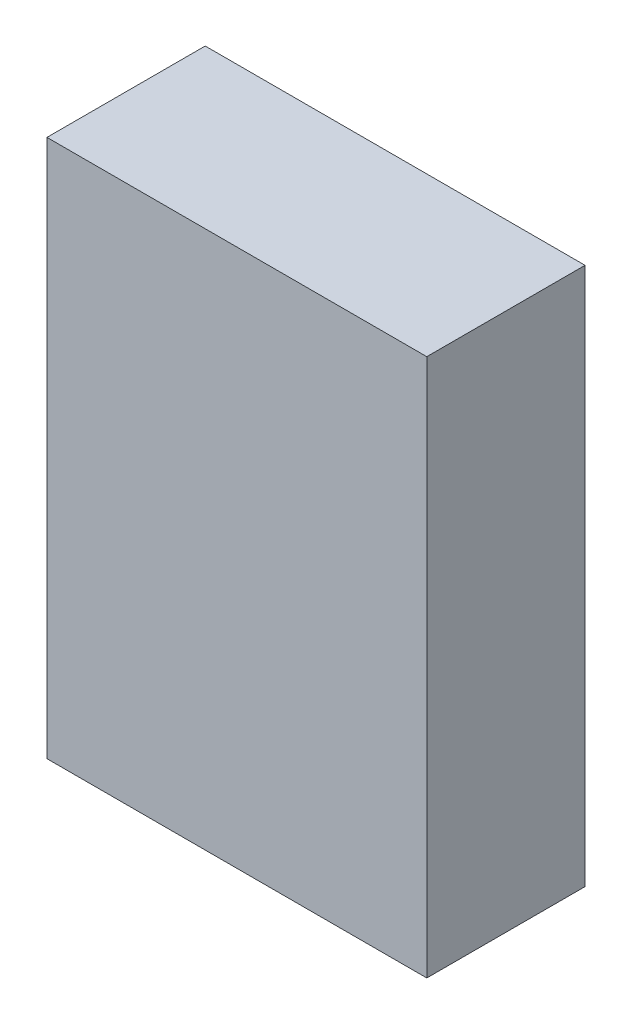
ISO-10303-21;
HEADER;
FILE_DESCRIPTION(('STEP AP214'),'2;1');
FILE_NAME('part.step','',(''),(''),'','','');
FILE_SCHEMA(('AUTOMOTIVE_DESIGN { 1 0 10303 214 1 1 1 1 }'));
ENDSEC;
DATA;
#1=APPLICATION_CONTEXT('core data for automotive mechanical design processes');
#2=APPLICATION_PROTOCOL_DEFINITION('international standard','automotive_design',2000,#1);
#3=PRODUCT_CONTEXT('',#1,'mechanical');
#4=PRODUCT('Part','Part','',(#3));
#5=PRODUCT_RELATED_PRODUCT_CATEGORY('part','',(#4));
#6=PRODUCT_DEFINITION_FORMATION('','',#4);
#7=PRODUCT_DEFINITION_CONTEXT('part definition',#1,'design');
#8=PRODUCT_DEFINITION('design','',#6,#7);
#9=PRODUCT_DEFINITION_SHAPE('','',#8);
#10=(LENGTH_UNIT() NAMED_UNIT(*) SI_UNIT(.MILLI.,.METRE.));
#11=(NAMED_UNIT(*) PLANE_ANGLE_UNIT() SI_UNIT($,.RADIAN.));
#12=(NAMED_UNIT(*) SI_UNIT($,.STERADIAN.) SOLID_ANGLE_UNIT());
#13=UNCERTAINTY_MEASURE_WITH_UNIT(LENGTH_MEASURE(1.E-05),#10,'distance_accuracy_value','');
#14=(GEOMETRIC_REPRESENTATION_CONTEXT(3) GLOBAL_UNCERTAINTY_ASSIGNED_CONTEXT((#13)) GLOBAL_UNIT_ASSIGNED_CONTEXT((#10,
#11,#12)) REPRESENTATION_CONTEXT('',''));
#15=CARTESIAN_POINT('',(0.,0.,0.));
#16=DIRECTION('',(0.,0.,1.));
#17=DIRECTION('',(1.,0.,0.));
#18=AXIS2_PLACEMENT_3D('',#15,#16,#17);
#19=CARTESIAN_POINT('',(-1.37,-2.92,0.));
#20=DIRECTION('',(1.,0.,0.));
#21=DIRECTION('',(0.,0.,1.));
#22=AXIS2_PLACEMENT_3D('',#19,#20,#21);
#23=PLANE('',#22);
#24=DIRECTION('',(0.,1.,0.));
#25=VECTOR('',#24,1.);
#26=CARTESIAN_POINT('',(-1.37,-2.92,0.1));
#27=LINE('',#26,#25);
#28=CARTESIAN_POINT('',(-1.37,-2.92,0.1));
#29=VERTEX_POINT('',#28);
#30=CARTESIAN_POINT('',(-1.37,-2.58,0.1));
#31=VERTEX_POINT('',#30);
#32=EDGE_CURVE('E11',#29,#31,#27,.T.);
#33=ORIENTED_EDGE('',*,*,#32,.T.);
#34=DIRECTION('',(0.,0.,1.));
#35=VECTOR('',#34,1.);
#36=CARTESIAN_POINT('',(-1.37,-2.58,0.));
#37=LINE('',#36,#35);
#38=CARTESIAN_POINT('',(-1.37,-2.58,0.));
#39=VERTEX_POINT('',#38);
#40=EDGE_CURVE('E24',#39,#31,#37,.T.);
#41=ORIENTED_EDGE('',*,*,#40,.F.);
#42=DIRECTION('',(0.,1.,0.));
#43=VECTOR('',#42,1.);
#44=CARTESIAN_POINT('',(-1.37,-2.92,0.));
#45=LINE('',#44,#43);
#46=CARTESIAN_POINT('',(-1.37,-2.92,0.));
#47=VERTEX_POINT('',#46);
#48=EDGE_CURVE('E86',#47,#39,#45,.T.);
#49=ORIENTED_EDGE('',*,*,#48,.F.);
#50=DIRECTION('',(0.,0.,1.));
#51=VECTOR('',#50,1.);
#52=CARTESIAN_POINT('',(-1.37,-2.92,0.));
#53=LINE('',#52,#51);
#54=EDGE_CURVE('E36',#47,#29,#53,.T.);
#55=ORIENTED_EDGE('',*,*,#54,.T.);
#56=EDGE_LOOP('',(#33,#41,#49,#55));
#57=FACE_BOUND('',#56,.T.);
#58=ADVANCED_FACE('F17',(#57),#23,.F.);
#59=CARTESIAN_POINT('',(-1.13,-2.92,0.));
#60=DIRECTION('',(1.,0.,0.));
#61=DIRECTION('',(0.,0.,1.));
#62=AXIS2_PLACEMENT_3D('',#59,#60,#61);
#63=PLANE('',#62);
#64=DIRECTION('',(0.,0.,1.));
#65=VECTOR('',#64,1.);
#66=CARTESIAN_POINT('',(-1.13,-2.92,0.));
#67=LINE('',#66,#65);
#68=CARTESIAN_POINT('',(-1.13,-2.92,0.));
#69=VERTEX_POINT('',#68);
#70=CARTESIAN_POINT('',(-1.13,-2.92,0.1));
#71=VERTEX_POINT('',#70);
#72=EDGE_CURVE('E83',#69,#71,#67,.T.);
#73=ORIENTED_EDGE('',*,*,#72,.F.);
#74=DIRECTION('',(0.,1.,0.));
#75=VECTOR('',#74,1.);
#76=CARTESIAN_POINT('',(-1.13,-2.92,0.));
#77=LINE('',#76,#75);
#78=CARTESIAN_POINT('',(-1.13,-2.58,0.));
#79=VERTEX_POINT('',#78);
#80=EDGE_CURVE('E63',#69,#79,#77,.T.);
#81=ORIENTED_EDGE('',*,*,#80,.T.);
#82=DIRECTION('',(0.,0.,1.));
#83=VECTOR('',#82,1.);
#84=CARTESIAN_POINT('',(-1.13,-2.58,0.));
#85=LINE('',#84,#83);
#86=CARTESIAN_POINT('',(-1.13,-2.58,0.1));
#87=VERTEX_POINT('',#86);
#88=EDGE_CURVE('E57',#79,#87,#85,.T.);
#89=ORIENTED_EDGE('',*,*,#88,.T.);
#90=DIRECTION('',(0.,1.,0.));
#91=VECTOR('',#90,1.);
#92=CARTESIAN_POINT('',(-1.13,-2.92,0.1));
#93=LINE('',#92,#91);
#94=EDGE_CURVE('E60',#71,#87,#93,.T.);
#95=ORIENTED_EDGE('',*,*,#94,.F.);
#96=EDGE_LOOP('',(#73,#81,#89,#95));
#97=FACE_BOUND('',#96,.T.);
#98=ADVANCED_FACE('F59',(#97),#63,.T.);
#99=CARTESIAN_POINT('',(-1.37,-2.92,0.));
#100=DIRECTION('',(0.,1.,0.));
#101=DIRECTION('',(0.,0.,1.));
#102=AXIS2_PLACEMENT_3D('',#99,#100,#101);
#103=PLANE('',#102);
#104=ORIENTED_EDGE('',*,*,#72,.T.);
#105=DIRECTION('',(1.,0.,0.));
#106=VECTOR('',#105,1.);
#107=CARTESIAN_POINT('',(-1.37,-2.92,0.1));
#108=LINE('',#107,#106);
#109=EDGE_CURVE('E71',#29,#71,#108,.T.);
#110=ORIENTED_EDGE('',*,*,#109,.F.);
#111=ORIENTED_EDGE('',*,*,#54,.F.);
#112=DIRECTION('',(1.,0.,0.));
#113=VECTOR('',#112,1.);
#114=CARTESIAN_POINT('',(-1.37,-2.92,0.));
#115=LINE('',#114,#113);
#116=EDGE_CURVE('E76',#47,#69,#115,.T.);
#117=ORIENTED_EDGE('',*,*,#116,.T.);
#118=EDGE_LOOP('',(#104,#110,#111,#117));
#119=FACE_BOUND('',#118,.T.);
#120=ADVANCED_FACE('F91',(#119),#103,.F.);
#121=CARTESIAN_POINT('',(-1.37,-2.58,0.));
#122=DIRECTION('',(0.,1.,0.));
#123=DIRECTION('',(0.,0.,1.));
#124=AXIS2_PLACEMENT_3D('',#121,#122,#123);
#125=PLANE('',#124);
#126=DIRECTION('',(1.,0.,0.));
#127=VECTOR('',#126,1.);
#128=CARTESIAN_POINT('',(-1.37,-2.58,0.));
#129=LINE('',#128,#127);
#130=EDGE_CURVE('E74',#39,#79,#129,.T.);
#131=ORIENTED_EDGE('',*,*,#130,.F.);
#132=ORIENTED_EDGE('',*,*,#40,.T.);
#133=DIRECTION('',(1.,0.,0.));
#134=VECTOR('',#133,1.);
#135=CARTESIAN_POINT('',(-1.37,-2.58,0.1));
#136=LINE('',#135,#134);
#137=EDGE_CURVE('E69',#31,#87,#136,.T.);
#138=ORIENTED_EDGE('',*,*,#137,.T.);
#139=ORIENTED_EDGE('',*,*,#88,.F.);
#140=EDGE_LOOP('',(#131,#132,#138,#139));
#141=FACE_BOUND('',#140,.T.);
#142=ADVANCED_FACE('F73',(#141),#125,.T.);
#143=CARTESIAN_POINT('',(-1.37,-2.92,0.));
#144=DIRECTION('',(0.,0.,1.));
#145=DIRECTION('',(1.,0.,0.));
#146=AXIS2_PLACEMENT_3D('',#143,#144,#145);
#147=PLANE('',#146);
#148=ORIENTED_EDGE('',*,*,#130,.T.);
#149=ORIENTED_EDGE('',*,*,#80,.F.);
#150=ORIENTED_EDGE('',*,*,#116,.F.);
#151=ORIENTED_EDGE('',*,*,#48,.T.);
#152=EDGE_LOOP('',(#148,#149,#150,#151));
#153=FACE_BOUND('',#152,.T.);
#154=ADVANCED_FACE('F89',(#153),#147,.F.);
#155=CARTESIAN_POINT('',(-1.37,-2.92,0.1));
#156=DIRECTION('',(0.,0.,1.));
#157=DIRECTION('',(1.,0.,0.));
#158=AXIS2_PLACEMENT_3D('',#155,#156,#157);
#159=PLANE('',#158);
#160=ORIENTED_EDGE('',*,*,#32,.F.);
#161=ORIENTED_EDGE('',*,*,#109,.T.);
#162=ORIENTED_EDGE('',*,*,#94,.T.);
#163=ORIENTED_EDGE('',*,*,#137,.F.);
#164=EDGE_LOOP('',(#160,#161,#162,#163));
#165=FACE_BOUND('',#164,.T.);
#166=ADVANCED_FACE('F68',(#165),#159,.T.);
#167=CLOSED_SHELL('',(#58,#98,#120,#142,#154,#166));
#168=MANIFOLD_SOLID_BREP('B1',#167);
#169=ADVANCED_BREP_SHAPE_REPRESENTATION('',(#18,#168),#14);
#170=SHAPE_DEFINITION_REPRESENTATION(#9,#169);
ENDSEC;
END-ISO-10303-21;
